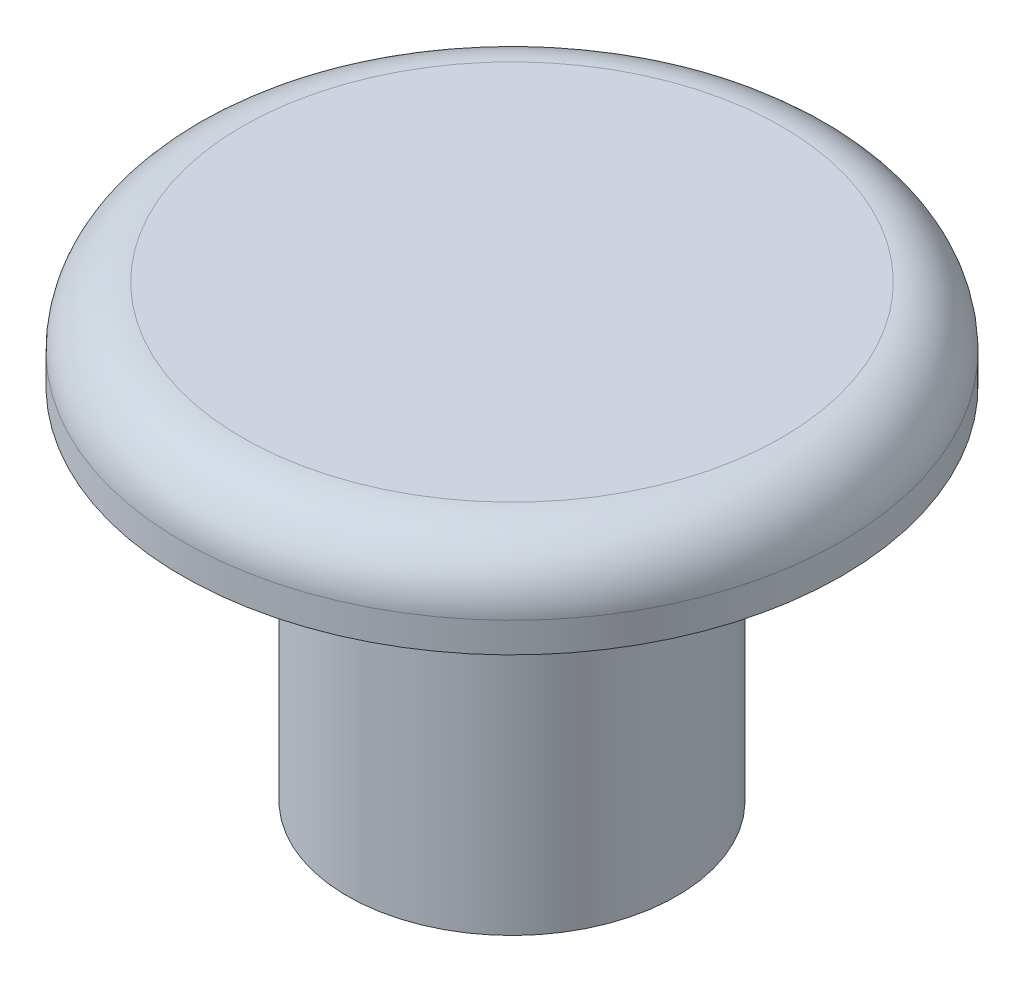
ISO-10303-21;
HEADER;
FILE_DESCRIPTION(('STEP AP214'),'2;1');
FILE_NAME('part.step','',(''),(''),'','','');
FILE_SCHEMA(('AUTOMOTIVE_DESIGN { 1 0 10303 214 1 1 1 1 }'));
ENDSEC;
DATA;
#1=APPLICATION_CONTEXT('core data for automotive mechanical design processes');
#2=APPLICATION_PROTOCOL_DEFINITION('international standard','automotive_design',2000,#1);
#3=PRODUCT_CONTEXT('',#1,'mechanical');
#4=PRODUCT('Part','Part','',(#3));
#5=PRODUCT_RELATED_PRODUCT_CATEGORY('part','',(#4));
#6=PRODUCT_DEFINITION_FORMATION('','',#4);
#7=PRODUCT_DEFINITION_CONTEXT('part definition',#1,'design');
#8=PRODUCT_DEFINITION('design','',#6,#7);
#9=PRODUCT_DEFINITION_SHAPE('','',#8);
#10=(LENGTH_UNIT() NAMED_UNIT(*) SI_UNIT(.MILLI.,.METRE.));
#11=(NAMED_UNIT(*) PLANE_ANGLE_UNIT() SI_UNIT($,.RADIAN.));
#12=(NAMED_UNIT(*) SI_UNIT($,.STERADIAN.) SOLID_ANGLE_UNIT());
#13=UNCERTAINTY_MEASURE_WITH_UNIT(LENGTH_MEASURE(1.E-05),#10,'distance_accuracy_value','');
#14=(GEOMETRIC_REPRESENTATION_CONTEXT(3) GLOBAL_UNCERTAINTY_ASSIGNED_CONTEXT((#13)) GLOBAL_UNIT_ASSIGNED_CONTEXT((#10,
#11,#12)) REPRESENTATION_CONTEXT('',''));
#15=CARTESIAN_POINT('',(0.,0.,0.));
#16=DIRECTION('',(0.,0.,1.));
#17=DIRECTION('',(1.,0.,0.));
#18=AXIS2_PLACEMENT_3D('',#15,#16,#17);
#19=CARTESIAN_POINT('',(0.,13.,0.));
#20=DIRECTION('',(0.,-1.,0.));
#21=DIRECTION('',(1.,0.,0.));
#22=AXIS2_PLACEMENT_3D('',#19,#20,#21);
#23=TOROIDAL_SURFACE('',#22,9.,2.);
#24=CARTESIAN_POINT('',(0.,15.,0.));
#25=DIRECTION('',(0.,-1.,0.));
#26=DIRECTION('',(1.,0.,0.));
#27=AXIS2_PLACEMENT_3D('',#24,#25,#26);
#28=CIRCLE('',#27,9.);
#29=CARTESIAN_POINT('',(9.,15.,0.));
#30=VERTEX_POINT('',#29);
#31=EDGE_CURVE('E37',#30,#30,#28,.F.);
#32=ORIENTED_EDGE('',*,*,#31,.F.);
#33=EDGE_LOOP('',(#32));
#34=FACE_BOUND('',#33,.T.);
#35=CARTESIAN_POINT('',(0.,13.,0.));
#36=DIRECTION('',(0.,-1.,0.));
#37=DIRECTION('',(1.,0.,0.));
#38=AXIS2_PLACEMENT_3D('',#35,#36,#37);
#39=CIRCLE('',#38,11.);
#40=CARTESIAN_POINT('',(11.,13.,0.));
#41=VERTEX_POINT('',#40);
#42=EDGE_CURVE('E10',#41,#41,#39,.T.);
#43=ORIENTED_EDGE('',*,*,#42,.F.);
#44=EDGE_LOOP('',(#43));
#45=FACE_BOUND('',#44,.T.);
#46=ADVANCED_FACE('F31',(#34,#45),#23,.T.);
#47=CARTESIAN_POINT('',(0.,0.,0.));
#48=DIRECTION('',(0.,1.,0.));
#49=DIRECTION('',(-1.,0.,0.));
#50=AXIS2_PLACEMENT_3D('',#47,#48,#49);
#51=PLANE('',#50);
#52=CARTESIAN_POINT('',(0.,0.,0.));
#53=DIRECTION('',(0.,1.,0.));
#54=DIRECTION('',(-1.,0.,0.));
#55=AXIS2_PLACEMENT_3D('',#52,#53,#54);
#56=CIRCLE('',#55,5.5);
#57=CARTESIAN_POINT('',(-5.5,0.,0.));
#58=VERTEX_POINT('',#57);
#59=EDGE_CURVE('E41',#58,#58,#56,.T.);
#60=ORIENTED_EDGE('',*,*,#59,.F.);
#61=EDGE_LOOP('',(#60));
#62=FACE_BOUND('',#61,.T.);
#63=ADVANCED_FACE('F65',(#62),#51,.F.);
#64=CARTESIAN_POINT('',(0.,15.,0.));
#65=DIRECTION('',(0.,1.,0.));
#66=DIRECTION('',(-1.,0.,0.));
#67=AXIS2_PLACEMENT_3D('',#64,#65,#66);
#68=CYLINDRICAL_SURFACE('',#67,5.5);
#69=CARTESIAN_POINT('',(0.,12.,0.));
#70=DIRECTION('',(0.,1.,0.));
#71=DIRECTION('',(-1.,0.,0.));
#72=AXIS2_PLACEMENT_3D('',#69,#70,#71);
#73=CIRCLE('',#72,5.5);
#74=CARTESIAN_POINT('',(-5.5,12.,0.));
#75=VERTEX_POINT('',#74);
#76=EDGE_CURVE('E45',#75,#75,#73,.T.);
#77=ORIENTED_EDGE('',*,*,#76,.F.);
#78=EDGE_LOOP('',(#77));
#79=FACE_BOUND('',#78,.T.);
#80=ORIENTED_EDGE('',*,*,#59,.T.);
#81=EDGE_LOOP('',(#80));
#82=FACE_BOUND('',#81,.T.);
#83=ADVANCED_FACE('F59',(#79,#82),#68,.T.);
#84=CARTESIAN_POINT('',(5.5,12.,0.));
#85=DIRECTION('',(0.,1.,0.));
#86=DIRECTION('',(-1.,0.,0.));
#87=AXIS2_PLACEMENT_3D('',#84,#85,#86);
#88=PLANE('',#87);
#89=CARTESIAN_POINT('',(0.,12.,0.));
#90=DIRECTION('',(0.,1.,0.));
#91=DIRECTION('',(-1.,0.,0.));
#92=AXIS2_PLACEMENT_3D('',#89,#90,#91);
#93=CIRCLE('',#92,11.);
#94=CARTESIAN_POINT('',(-11.,12.,0.));
#95=VERTEX_POINT('',#94);
#96=EDGE_CURVE('E50',#95,#95,#93,.T.);
#97=ORIENTED_EDGE('',*,*,#96,.F.);
#98=EDGE_LOOP('',(#97));
#99=FACE_BOUND('',#98,.T.);
#100=ORIENTED_EDGE('',*,*,#76,.T.);
#101=EDGE_LOOP('',(#100));
#102=FACE_BOUND('',#101,.T.);
#103=ADVANCED_FACE('F56',(#99,#102),#88,.F.);
#104=CARTESIAN_POINT('',(0.,15.,0.));
#105=DIRECTION('',(0.,1.,0.));
#106=DIRECTION('',(-1.,0.,0.));
#107=AXIS2_PLACEMENT_3D('',#104,#105,#106);
#108=CYLINDRICAL_SURFACE('',#107,11.);
#109=ORIENTED_EDGE('',*,*,#42,.T.);
#110=EDGE_LOOP('',(#109));
#111=FACE_BOUND('',#110,.T.);
#112=ORIENTED_EDGE('',*,*,#96,.T.);
#113=EDGE_LOOP('',(#112));
#114=FACE_BOUND('',#113,.T.);
#115=ADVANCED_FACE('F54',(#111,#114),#108,.T.);
#116=CARTESIAN_POINT('',(11.,15.,0.));
#117=DIRECTION('',(0.,-1.,0.));
#118=DIRECTION('',(1.,0.,0.));
#119=AXIS2_PLACEMENT_3D('',#116,#117,#118);
#120=PLANE('',#119);
#121=ORIENTED_EDGE('',*,*,#31,.T.);
#122=EDGE_LOOP('',(#121));
#123=FACE_BOUND('',#122,.T.);
#124=ADVANCED_FACE('F77',(#123),#120,.F.);
#125=CLOSED_SHELL('',(#46,#63,#83,#103,#115,#124));
#126=MANIFOLD_SOLID_BREP('B2',#125);
#127=ADVANCED_BREP_SHAPE_REPRESENTATION('',(#18,#126),#14);
#128=SHAPE_DEFINITION_REPRESENTATION(#9,#127);
ENDSEC;
END-ISO-10303-21;
